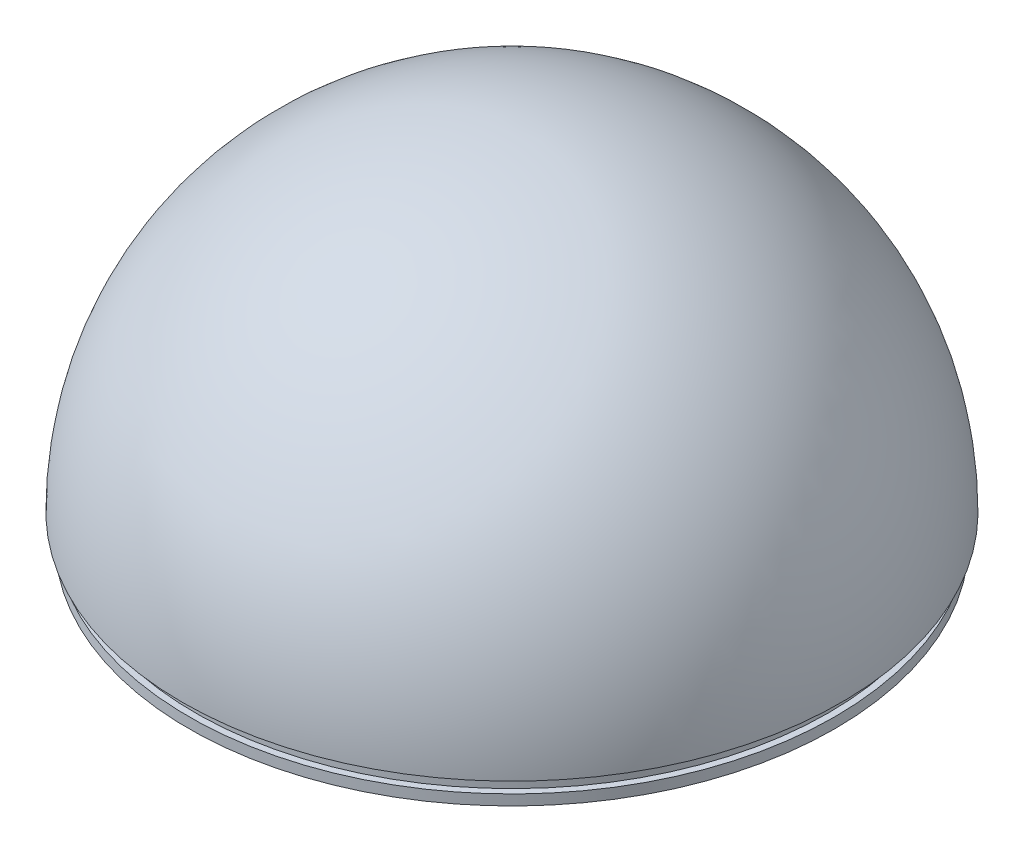
ISO-10303-21;
HEADER;
FILE_DESCRIPTION(('STEP AP214'),'2;1');
FILE_NAME('part.step','',(''),(''),'','','');
FILE_SCHEMA(('AUTOMOTIVE_DESIGN { 1 0 10303 214 1 1 1 1 }'));
ENDSEC;
DATA;
#1=APPLICATION_CONTEXT('core data for automotive mechanical design processes');
#2=APPLICATION_PROTOCOL_DEFINITION('international standard','automotive_design',2000,#1);
#3=PRODUCT_CONTEXT('',#1,'mechanical');
#4=PRODUCT('Part','Part','',(#3));
#5=PRODUCT_RELATED_PRODUCT_CATEGORY('part','',(#4));
#6=PRODUCT_DEFINITION_FORMATION('','',#4);
#7=PRODUCT_DEFINITION_CONTEXT('part definition',#1,'design');
#8=PRODUCT_DEFINITION('design','',#6,#7);
#9=PRODUCT_DEFINITION_SHAPE('','',#8);
#10=(LENGTH_UNIT() NAMED_UNIT(*) SI_UNIT(.MILLI.,.METRE.));
#11=(NAMED_UNIT(*) PLANE_ANGLE_UNIT() SI_UNIT($,.RADIAN.));
#12=(NAMED_UNIT(*) SI_UNIT($,.STERADIAN.) SOLID_ANGLE_UNIT());
#13=UNCERTAINTY_MEASURE_WITH_UNIT(LENGTH_MEASURE(1.E-05),#10,'distance_accuracy_value','');
#14=(GEOMETRIC_REPRESENTATION_CONTEXT(3) GLOBAL_UNCERTAINTY_ASSIGNED_CONTEXT((#13)) GLOBAL_UNIT_ASSIGNED_CONTEXT((#10,
#11,#12)) REPRESENTATION_CONTEXT('',''));
#15=CARTESIAN_POINT('',(0.,0.,0.));
#16=DIRECTION('',(0.,0.,1.));
#17=DIRECTION('',(1.,0.,0.));
#18=AXIS2_PLACEMENT_3D('',#15,#16,#17);
#19=CARTESIAN_POINT('',(0.,-2.,0.));
#20=DIRECTION('',(0.,-1.,0.));
#21=DIRECTION('',(1.,0.,0.));
#22=AXIS2_PLACEMENT_3D('',#19,#20,#21);
#23=PLANE('',#22);
#24=CARTESIAN_POINT('',(0.,-2.,0.));
#25=DIRECTION('',(0.,-1.,0.));
#26=DIRECTION('',(1.,0.,0.));
#27=AXIS2_PLACEMENT_3D('',#24,#25,#26);
#28=CIRCLE('',#27,24.75);
#29=CARTESIAN_POINT('',(24.75,-1.99999999999983,0.));
#30=VERTEX_POINT('',#29);
#31=EDGE_CURVE('E45',#30,#30,#28,.T.);
#32=ORIENTED_EDGE('',*,*,#31,.T.);
#33=EDGE_LOOP('',(#32));
#34=FACE_BOUND('',#33,.T.);
#35=CARTESIAN_POINT('',(0.,-2.,0.));
#36=DIRECTION('',(0.,-1.,0.));
#37=DIRECTION('',(1.,0.,0.));
#38=AXIS2_PLACEMENT_3D('',#35,#36,#37);
#39=CIRCLE('',#38,23.25);
#40=CARTESIAN_POINT('',(23.25,-1.99999999999984,0.));
#41=VERTEX_POINT('',#40);
#42=EDGE_CURVE('E50',#41,#41,#39,.T.);
#43=ORIENTED_EDGE('',*,*,#42,.F.);
#44=EDGE_LOOP('',(#43));
#45=FACE_BOUND('',#44,.T.);
#46=ADVANCED_FACE('F37',(#34,#45),#23,.T.);
#47=CARTESIAN_POINT('',(0.,-2.,0.));
#48=DIRECTION('',(0.,1.,0.));
#49=DIRECTION('',(-1.,0.,0.));
#50=AXIS2_PLACEMENT_3D('',#47,#48,#49);
#51=CYLINDRICAL_SURFACE('',#50,24.75);
#52=CARTESIAN_POINT('',(0.,-1.2,0.));
#53=DIRECTION('',(0.,-1.,0.));
#54=DIRECTION('',(1.,0.,0.));
#55=AXIS2_PLACEMENT_3D('',#52,#53,#54);
#56=CIRCLE('',#55,24.75);
#57=CARTESIAN_POINT('',(24.75,-1.19999999999983,0.));
#58=VERTEX_POINT('',#57);
#59=EDGE_CURVE('E60',#58,#58,#56,.T.);
#60=ORIENTED_EDGE('',*,*,#59,.T.);
#61=EDGE_LOOP('',(#60));
#62=FACE_BOUND('',#61,.T.);
#63=ORIENTED_EDGE('',*,*,#31,.F.);
#64=EDGE_LOOP('',(#63));
#65=FACE_BOUND('',#64,.T.);
#66=ADVANCED_FACE('F92',(#62,#65),#51,.T.);
#67=CARTESIAN_POINT('',(0.,-2.,0.));
#68=DIRECTION('',(0.,1.,0.));
#69=DIRECTION('',(-1.,0.,0.));
#70=AXIS2_PLACEMENT_3D('',#67,#68,#69);
#71=CYLINDRICAL_SURFACE('',#70,23.25);
#72=ORIENTED_EDGE('',*,*,#42,.T.);
#73=EDGE_LOOP('',(#72));
#74=FACE_BOUND('',#73,.T.);
#75=CARTESIAN_POINT('',(0.,0.,0.));
#76=DIRECTION('',(0.,-1.,0.));
#77=DIRECTION('',(1.,0.,0.));
#78=AXIS2_PLACEMENT_3D('',#75,#76,#77);
#79=CIRCLE('',#78,23.25);
#80=CARTESIAN_POINT('',(23.25,1.62353882256206E-13,0.));
#81=VERTEX_POINT('',#80);
#82=EDGE_CURVE('E55',#81,#81,#79,.T.);
#83=ORIENTED_EDGE('',*,*,#82,.F.);
#84=EDGE_LOOP('',(#83));
#85=FACE_BOUND('',#84,.T.);
#86=ADVANCED_FACE('F97',(#74,#85),#71,.F.);
#87=CARTESIAN_POINT('',(0.,0.,0.));
#88=DIRECTION('',(0.,0.,-1.));
#89=DIRECTION('',(-1.,0.,0.));
#90=AXIS2_PLACEMENT_3D('',#87,#88,#89);
#91=SPHERICAL_SURFACE('',#90,23.25);
#92=CARTESIAN_POINT('',(0.,0.,0.));
#93=DIRECTION('',(0.,-1.,0.));
#94=DIRECTION('',(1.,0.,0.));
#95=AXIS2_PLACEMENT_3D('',#92,#93,#94);
#96=SPHERICAL_SURFACE('',#95,23.25);
#97=ORIENTED_EDGE('',*,*,#82,.T.);
#98=EDGE_LOOP('',(#97));
#99=FACE_BOUND('',#98,.T.);
#100=ADVANCED_FACE('F39',(#99),#96,.F.);
#101=CARTESIAN_POINT('',(0.,-1.2,0.));
#102=DIRECTION('',(0.,-1.,0.));
#103=DIRECTION('',(1.,0.,0.));
#104=AXIS2_PLACEMENT_3D('',#101,#102,#103);
#105=PLANE('',#104);
#106=ORIENTED_EDGE('',*,*,#59,.F.);
#107=EDGE_LOOP('',(#106));
#108=FACE_BOUND('',#107,.T.);
#109=CARTESIAN_POINT('',(0.,-1.2,0.));
#110=DIRECTION('',(0.,-1.,0.));
#111=DIRECTION('',(1.,0.,0.));
#112=AXIS2_PLACEMENT_3D('',#109,#110,#111);
#113=CIRCLE('',#112,24.25);
#114=CARTESIAN_POINT('',(24.25,-1.19999999999983,0.));
#115=VERTEX_POINT('',#114);
#116=EDGE_CURVE('E65',#115,#115,#113,.T.);
#117=ORIENTED_EDGE('',*,*,#116,.T.);
#118=EDGE_LOOP('',(#117));
#119=FACE_BOUND('',#118,.T.);
#120=ADVANCED_FACE('F74',(#108,#119),#105,.F.);
#121=CARTESIAN_POINT('',(0.,-1.2,0.));
#122=DIRECTION('',(0.,1.,0.));
#123=DIRECTION('',(-1.,0.,0.));
#124=AXIS2_PLACEMENT_3D('',#121,#122,#123);
#125=CYLINDRICAL_SURFACE('',#124,24.25);
#126=ORIENTED_EDGE('',*,*,#116,.F.);
#127=EDGE_LOOP('',(#126));
#128=FACE_BOUND('',#127,.T.);
#129=CARTESIAN_POINT('',(0.,0.,0.));
#130=DIRECTION('',(0.,-1.,0.));
#131=DIRECTION('',(1.,0.,0.));
#132=AXIS2_PLACEMENT_3D('',#129,#130,#131);
#133=CIRCLE('',#132,24.25);
#134=CARTESIAN_POINT('',(24.25,1.69336844933892E-13,0.));
#135=VERTEX_POINT('',#134);
#136=EDGE_CURVE('E66',#135,#135,#133,.T.);
#137=ORIENTED_EDGE('',*,*,#136,.T.);
#138=EDGE_LOOP('',(#137));
#139=FACE_BOUND('',#138,.T.);
#140=ADVANCED_FACE('F76',(#128,#139),#125,.T.);
#141=CARTESIAN_POINT('',(0.,0.,0.));
#142=DIRECTION('',(0.,0.,-1.));
#143=DIRECTION('',(-1.,0.,0.));
#144=AXIS2_PLACEMENT_3D('',#141,#142,#143);
#145=SPHERICAL_SURFACE('',#144,25.25);
#146=CARTESIAN_POINT('',(0.,0.,0.));
#147=DIRECTION('',(0.,-1.,0.));
#148=DIRECTION('',(0.,0.,1.));
#149=AXIS2_PLACEMENT_3D('',#146,#147,#148);
#150=SPHERICAL_SURFACE('',#149,25.25);
#151=CARTESIAN_POINT('',(0.,0.,0.));
#152=DIRECTION('',(0.,-1.,0.));
#153=DIRECTION('',(0.,0.,1.));
#154=AXIS2_PLACEMENT_3D('',#151,#152,#153);
#155=CIRCLE('',#154,25.25);
#156=CARTESIAN_POINT('',(0.,0.,25.25));
#157=VERTEX_POINT('',#156);
#158=EDGE_CURVE('E10',#157,#157,#155,.T.);
#159=ORIENTED_EDGE('',*,*,#158,.F.);
#160=EDGE_LOOP('',(#159));
#161=FACE_BOUND('',#160,.T.);
#162=ADVANCED_FACE('F79',(#161),#150,.T.);
#163=CARTESIAN_POINT('',(0.,0.,0.));
#164=DIRECTION('',(0.,-1.,0.));
#165=DIRECTION('',(0.,0.,1.));
#166=AXIS2_PLACEMENT_3D('',#163,#164,#165);
#167=PLANE('',#166);
#168=ORIENTED_EDGE('',*,*,#158,.T.);
#169=EDGE_LOOP('',(#168));
#170=FACE_BOUND('',#169,.T.);
#171=ORIENTED_EDGE('',*,*,#136,.F.);
#172=EDGE_LOOP('',(#171));
#173=FACE_BOUND('',#172,.T.);
#174=ADVANCED_FACE('F83',(#170,#173),#167,.T.);
#175=CLOSED_SHELL('',(#46,#66,#86,#100,#120,#140,#162,#174));
#176=MANIFOLD_SOLID_BREP('B2',#175);
#177=ADVANCED_BREP_SHAPE_REPRESENTATION('',(#18,#176),#14);
#178=SHAPE_DEFINITION_REPRESENTATION(#9,#177);
ENDSEC;
END-ISO-10303-21;
